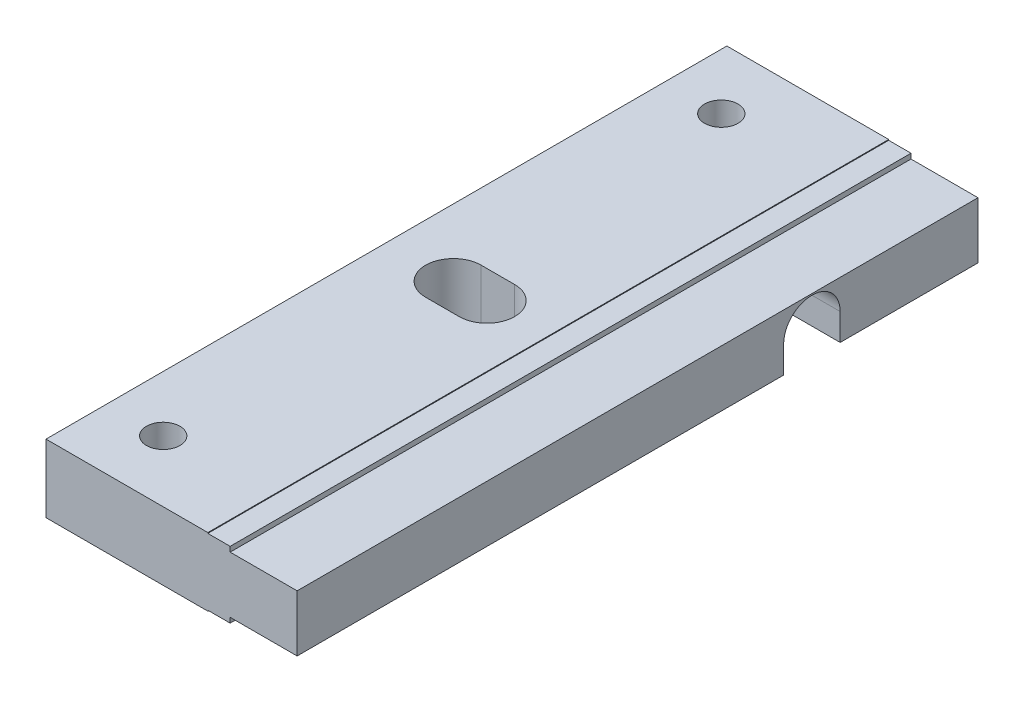
ISO-10303-21;
HEADER;
FILE_DESCRIPTION(('STEP AP214'),'2;1');
FILE_NAME('part.step','',(''),(''),'','','');
FILE_SCHEMA(('AUTOMOTIVE_DESIGN { 1 0 10303 214 1 1 1 1 }'));
ENDSEC;
DATA;
#1=APPLICATION_CONTEXT('core data for automotive mechanical design processes');
#2=APPLICATION_PROTOCOL_DEFINITION('international standard','automotive_design',2000,#1);
#3=PRODUCT_CONTEXT('',#1,'mechanical');
#4=PRODUCT('Part','Part','',(#3));
#5=PRODUCT_RELATED_PRODUCT_CATEGORY('part','',(#4));
#6=PRODUCT_DEFINITION_FORMATION('','',#4);
#7=PRODUCT_DEFINITION_CONTEXT('part definition',#1,'design');
#8=PRODUCT_DEFINITION('design','',#6,#7);
#9=PRODUCT_DEFINITION_SHAPE('','',#8);
#10=(LENGTH_UNIT() NAMED_UNIT(*) SI_UNIT(.MILLI.,.METRE.));
#11=(NAMED_UNIT(*) PLANE_ANGLE_UNIT() SI_UNIT($,.RADIAN.));
#12=(NAMED_UNIT(*) SI_UNIT($,.STERADIAN.) SOLID_ANGLE_UNIT());
#13=UNCERTAINTY_MEASURE_WITH_UNIT(LENGTH_MEASURE(1.E-05),#10,'distance_accuracy_value','');
#14=(GEOMETRIC_REPRESENTATION_CONTEXT(3) GLOBAL_UNCERTAINTY_ASSIGNED_CONTEXT((#13)) GLOBAL_UNIT_ASSIGNED_CONTEXT((#10,
#11,#12)) REPRESENTATION_CONTEXT('',''));
#15=CARTESIAN_POINT('',(0.,0.,0.));
#16=DIRECTION('',(0.,0.,1.));
#17=DIRECTION('',(1.,0.,0.));
#18=AXIS2_PLACEMENT_3D('',#15,#16,#17);
#19=CARTESIAN_POINT('',(22.5,-3.05,0.));
#20=DIRECTION('',(0.,1.,0.));
#21=DIRECTION('',(0.,0.,1.));
#22=AXIS2_PLACEMENT_3D('',#19,#20,#21);
#23=PLANE('',#22);
#24=CARTESIAN_POINT('',(5.00000000000001,-3.05,-5.5));
#25=DIRECTION('',(0.,1.,0.));
#26=DIRECTION('',(0.,0.,1.));
#27=AXIS2_PLACEMENT_3D('',#24,#25,#26);
#28=CIRCLE('',#27,1.5);
#29=CARTESIAN_POINT('',(5.00000000000001,-3.05,-4.));
#30=VERTEX_POINT('',#29);
#31=EDGE_CURVE('E272',#30,#30,#28,.T.);
#32=ORIENTED_EDGE('',*,*,#31,.T.);
#33=EDGE_LOOP('',(#32));
#34=FACE_BOUND('',#33,.T.);
#35=DIRECTION('',(-1.,0.,0.));
#36=VECTOR('',#35,1.);
#37=CARTESIAN_POINT('',(6.,-3.05,-32.9892));
#38=LINE('',#37,#36);
#39=CARTESIAN_POINT('',(9.,-3.05,-32.9892));
#40=VERTEX_POINT('',#39);
#41=CARTESIAN_POINT('',(6.,-3.05,-32.9892));
#42=VERTEX_POINT('',#41);
#43=EDGE_CURVE('E294',#40,#42,#38,.T.);
#44=ORIENTED_EDGE('',*,*,#43,.T.);
#45=CARTESIAN_POINT('',(6.,-3.05,-30.5));
#46=DIRECTION('',(0.,1.,0.));
#47=DIRECTION('',(0.,0.,1.));
#48=AXIS2_PLACEMENT_3D('',#45,#46,#47);
#49=CIRCLE('',#48,2.4892);
#50=CARTESIAN_POINT('',(6.,-3.05,-28.0108));
#51=VERTEX_POINT('',#50);
#52=EDGE_CURVE('E284',#42,#51,#49,.T.);
#53=ORIENTED_EDGE('',*,*,#52,.T.);
#54=DIRECTION('',(1.,0.,0.));
#55=VECTOR('',#54,1.);
#56=CARTESIAN_POINT('',(6.,-3.05,-28.0108));
#57=LINE('',#56,#55);
#58=CARTESIAN_POINT('',(9.,-3.05,-28.0108));
#59=VERTEX_POINT('',#58);
#60=EDGE_CURVE('E287',#51,#59,#57,.T.);
#61=ORIENTED_EDGE('',*,*,#60,.T.);
#62=CARTESIAN_POINT('',(9.,-3.05,-30.5));
#63=DIRECTION('',(0.,1.,0.));
#64=DIRECTION('',(0.,0.,1.));
#65=AXIS2_PLACEMENT_3D('',#62,#63,#64);
#66=CIRCLE('',#65,2.4892);
#67=EDGE_CURVE('E291',#59,#40,#66,.T.);
#68=ORIENTED_EDGE('',*,*,#67,.T.);
#69=EDGE_LOOP('',(#44,#53,#61,#68));
#70=FACE_BOUND('',#69,.T.);
#71=DIRECTION('',(-1.,0.,0.));
#72=VECTOR('',#71,1.);
#73=CARTESIAN_POINT('',(22.5,-3.05,-43.5866));
#74=LINE('',#73,#72);
#75=CARTESIAN_POINT('',(14.5,-3.05,-43.5866));
#76=VERTEX_POINT('',#75);
#77=CARTESIAN_POINT('',(0.,-3.05,-43.5866));
#78=VERTEX_POINT('',#77);
#79=EDGE_CURVE('E335',#76,#78,#74,.T.);
#80=ORIENTED_EDGE('',*,*,#79,.F.);
#81=DIRECTION('',(0.,0.,1.));
#82=VECTOR('',#81,1.);
#83=CARTESIAN_POINT('',(14.5,-3.05,-61.));
#84=LINE('',#83,#82);
#85=CARTESIAN_POINT('',(14.5,-3.05,0.));
#86=VERTEX_POINT('',#85);
#87=EDGE_CURVE('E257',#76,#86,#84,.T.);
#88=ORIENTED_EDGE('',*,*,#87,.T.);
#89=DIRECTION('',(-1.,0.,0.));
#90=VECTOR('',#89,1.);
#91=CARTESIAN_POINT('',(22.5,-3.05,0.));
#92=LINE('',#91,#90);
#93=CARTESIAN_POINT('',(0.,-3.05,0.));
#94=VERTEX_POINT('',#93);
#95=EDGE_CURVE('E225',#86,#94,#92,.T.);
#96=ORIENTED_EDGE('',*,*,#95,.T.);
#97=DIRECTION('',(0.,0.,-1.));
#98=VECTOR('',#97,1.);
#99=CARTESIAN_POINT('',(0.,-3.05,0.));
#100=LINE('',#99,#98);
#101=EDGE_CURVE('E354',#94,#78,#100,.T.);
#102=ORIENTED_EDGE('',*,*,#101,.T.);
#103=EDGE_LOOP('',(#80,#88,#96,#102));
#104=FACE_BOUND('',#103,.T.);
#105=ADVANCED_FACE('F36',(#34,#70,#104),#23,.F.);
#106=CARTESIAN_POINT('',(16.5,0.,-30.5));
#107=DIRECTION('',(1.,0.,0.));
#108=DIRECTION('',(0.,0.,-1.));
#109=AXIS2_PLACEMENT_3D('',#106,#107,#108);
#110=PLANE('',#109);
#111=DIRECTION('',(0.,0.,1.));
#112=VECTOR('',#111,1.);
#113=CARTESIAN_POINT('',(16.5,-2.98142,-61.));
#114=LINE('',#113,#112);
#115=CARTESIAN_POINT('',(16.5,-2.98142,-43.5866));
#116=VERTEX_POINT('',#115);
#117=CARTESIAN_POINT('',(16.5,-2.98142,0.));
#118=VERTEX_POINT('',#117);
#119=EDGE_CURVE('E256',#116,#118,#114,.T.);
#120=ORIENTED_EDGE('',*,*,#119,.F.);
#121=DIRECTION('',(0.,-1.,0.));
#122=VECTOR('',#121,1.);
#123=CARTESIAN_POINT('',(16.5,0.,-43.5866));
#124=LINE('',#123,#122);
#125=CARTESIAN_POINT('',(16.5,-2.52902000000001,-43.5866));
#126=VERTEX_POINT('',#125);
#127=EDGE_CURVE('E59',#126,#116,#124,.T.);
#128=ORIENTED_EDGE('',*,*,#127,.F.);
#129=DIRECTION('',(0.,0.,1.));
#130=VECTOR('',#129,1.);
#131=CARTESIAN_POINT('',(16.5,-2.52902000000001,-61.));
#132=LINE('',#131,#130);
#133=CARTESIAN_POINT('',(16.5,-2.52902000000001,0.));
#134=VERTEX_POINT('',#133);
#135=EDGE_CURVE('E396',#126,#134,#132,.T.);
#136=ORIENTED_EDGE('',*,*,#135,.T.);
#137=DIRECTION('',(0.,-1.,0.));
#138=VECTOR('',#137,1.);
#139=CARTESIAN_POINT('',(16.5,-3.05,0.));
#140=LINE('',#139,#138);
#141=EDGE_CURVE('E344',#134,#118,#140,.T.);
#142=ORIENTED_EDGE('',*,*,#141,.T.);
#143=EDGE_LOOP('',(#120,#128,#136,#142));
#144=FACE_BOUND('',#143,.T.);
#145=ADVANCED_FACE('F421',(#144),#110,.T.);
#146=CARTESIAN_POINT('',(22.5,-3.05,0.));
#147=DIRECTION('',(0.,0.,-1.));
#148=DIRECTION('',(-1.,0.,0.));
#149=AXIS2_PLACEMENT_3D('',#146,#147,#148);
#150=PLANE('',#149);
#151=CARTESIAN_POINT('',(16.5,2.98142,0.));
#152=VERTEX_POINT('',#151);
#153=CARTESIAN_POINT('',(16.5,2.52902,0.));
#154=VERTEX_POINT('',#153);
#155=EDGE_CURVE('E341',#152,#154,#140,.T.);
#156=ORIENTED_EDGE('',*,*,#155,.F.);
#157=DIRECTION('',(1.,0.,0.));
#158=VECTOR('',#157,1.);
#159=CARTESIAN_POINT('',(16.5,2.98142,0.));
#160=LINE('',#159,#158);
#161=CARTESIAN_POINT('',(14.5,2.98142,0.));
#162=VERTEX_POINT('',#161);
#163=EDGE_CURVE('E51',#162,#152,#160,.T.);
#164=ORIENTED_EDGE('',*,*,#163,.F.);
#165=DIRECTION('',(0.,-1.,0.));
#166=VECTOR('',#165,1.);
#167=CARTESIAN_POINT('',(14.5,3.05,0.));
#168=LINE('',#167,#166);
#169=CARTESIAN_POINT('',(14.5,3.05,0.));
#170=VERTEX_POINT('',#169);
#171=EDGE_CURVE('E366',#170,#162,#168,.T.);
#172=ORIENTED_EDGE('',*,*,#171,.F.);
#173=DIRECTION('',(-1.,0.,0.));
#174=VECTOR('',#173,1.);
#175=CARTESIAN_POINT('',(22.5,3.05,0.));
#176=LINE('',#175,#174);
#177=CARTESIAN_POINT('',(0.,3.05,0.));
#178=VERTEX_POINT('',#177);
#179=EDGE_CURVE('E217',#170,#178,#176,.T.);
#180=ORIENTED_EDGE('',*,*,#179,.T.);
#181=DIRECTION('',(0.,-1.,0.));
#182=VECTOR('',#181,1.);
#183=CARTESIAN_POINT('',(0.,-3.05,0.));
#184=LINE('',#183,#182);
#185=EDGE_CURVE('E350',#178,#94,#184,.T.);
#186=ORIENTED_EDGE('',*,*,#185,.T.);
#187=ORIENTED_EDGE('',*,*,#95,.F.);
#188=DIRECTION('',(0.,-1.,0.));
#189=VECTOR('',#188,1.);
#190=CARTESIAN_POINT('',(14.5,-2.98142,0.));
#191=LINE('',#190,#189);
#192=CARTESIAN_POINT('',(14.5,-2.98142,0.));
#193=VERTEX_POINT('',#192);
#194=EDGE_CURVE('E401',#193,#86,#191,.T.);
#195=ORIENTED_EDGE('',*,*,#194,.F.);
#196=DIRECTION('',(-1.,0.,0.));
#197=VECTOR('',#196,1.);
#198=CARTESIAN_POINT('',(14.5,-2.98142,0.));
#199=LINE('',#198,#197);
#200=EDGE_CURVE('E404',#118,#193,#199,.T.);
#201=ORIENTED_EDGE('',*,*,#200,.F.);
#202=ORIENTED_EDGE('',*,*,#141,.F.);
#203=DIRECTION('',(-1.,0.,0.));
#204=VECTOR('',#203,1.);
#205=CARTESIAN_POINT('',(16.5,-2.52902000000001,0.));
#206=LINE('',#205,#204);
#207=CARTESIAN_POINT('',(22.5,-2.52902000000001,0.));
#208=VERTEX_POINT('',#207);
#209=EDGE_CURVE('E383',#208,#134,#206,.T.);
#210=ORIENTED_EDGE('',*,*,#209,.F.);
#211=DIRECTION('',(0.,-1.,0.));
#212=VECTOR('',#211,1.);
#213=CARTESIAN_POINT('',(22.5,-3.05,0.));
#214=LINE('',#213,#212);
#215=CARTESIAN_POINT('',(22.5,2.52902,0.));
#216=VERTEX_POINT('',#215);
#217=EDGE_CURVE('E345',#216,#208,#214,.T.);
#218=ORIENTED_EDGE('',*,*,#217,.F.);
#219=DIRECTION('',(1.,0.,0.));
#220=VECTOR('',#219,1.);
#221=CARTESIAN_POINT('',(22.5,2.52902,0.));
#222=LINE('',#221,#220);
#223=EDGE_CURVE('E373',#154,#216,#222,.T.);
#224=ORIENTED_EDGE('',*,*,#223,.F.);
#225=EDGE_LOOP('',(#156,#164,#172,#180,#186,#187,#195,#201,#202,#210,#218,#224));
#226=FACE_BOUND('',#225,.T.);
#227=ADVANCED_FACE('F38',(#226),#150,.F.);
#228=CARTESIAN_POINT('',(5.,-3.05,-55.5));
#229=DIRECTION('',(0.,1.,0.));
#230=DIRECTION('',(0.,0.,1.));
#231=AXIS2_PLACEMENT_3D('',#228,#229,#230);
#232=CIRCLE('',#231,1.5);
#233=CARTESIAN_POINT('',(5.,-3.05,-54.));
#234=VERTEX_POINT('',#233);
#235=EDGE_CURVE('E278',#234,#234,#232,.T.);
#236=ORIENTED_EDGE('',*,*,#235,.T.);
#237=EDGE_LOOP('',(#236));
#238=FACE_BOUND('',#237,.T.);
#239=DIRECTION('',(-1.,0.,0.));
#240=VECTOR('',#239,1.);
#241=CARTESIAN_POINT('',(22.5,-3.05,-61.));
#242=LINE('',#241,#240);
#243=CARTESIAN_POINT('',(14.5,-3.05,-61.));
#244=VERTEX_POINT('',#243);
#245=CARTESIAN_POINT('',(0.,-3.05,-61.));
#246=VERTEX_POINT('',#245);
#247=EDGE_CURVE('E223',#244,#246,#242,.T.);
#248=ORIENTED_EDGE('',*,*,#247,.F.);
#249=CARTESIAN_POINT('',(14.5,-3.05,-48.6514));
#250=VERTEX_POINT('',#249);
#251=EDGE_CURVE('E249',#244,#250,#84,.T.);
#252=ORIENTED_EDGE('',*,*,#251,.T.);
#253=DIRECTION('',(-1.,0.,0.));
#254=VECTOR('',#253,1.);
#255=CARTESIAN_POINT('',(22.5,-3.05,-48.6514));
#256=LINE('',#255,#254);
#257=CARTESIAN_POINT('',(0.,-3.05,-48.6514));
#258=VERTEX_POINT('',#257);
#259=EDGE_CURVE('E243',#250,#258,#256,.T.);
#260=ORIENTED_EDGE('',*,*,#259,.T.);
#261=EDGE_CURVE('E353',#258,#246,#100,.T.);
#262=ORIENTED_EDGE('',*,*,#261,.T.);
#263=EDGE_LOOP('',(#248,#252,#260,#262));
#264=FACE_BOUND('',#263,.T.);
#265=ADVANCED_FACE('F254',(#238,#264),#23,.F.);
#266=CARTESIAN_POINT('',(22.5,-3.05,-61.));
#267=DIRECTION('',(0.,0.,1.));
#268=DIRECTION('',(1.,0.,0.));
#269=AXIS2_PLACEMENT_3D('',#266,#267,#268);
#270=PLANE('',#269);
#271=DIRECTION('',(0.,-1.,0.));
#272=VECTOR('',#271,1.);
#273=CARTESIAN_POINT('',(14.5,3.05,-61.));
#274=LINE('',#273,#272);
#275=CARTESIAN_POINT('',(14.5,3.05,-61.));
#276=VERTEX_POINT('',#275);
#277=CARTESIAN_POINT('',(14.5,2.98142,-61.));
#278=VERTEX_POINT('',#277);
#279=EDGE_CURVE('E198',#276,#278,#274,.T.);
#280=ORIENTED_EDGE('',*,*,#279,.T.);
#281=DIRECTION('',(1.,0.,0.));
#282=VECTOR('',#281,1.);
#283=CARTESIAN_POINT('',(16.5,2.98142,-61.));
#284=LINE('',#283,#282);
#285=CARTESIAN_POINT('',(16.5,2.98142,-61.));
#286=VERTEX_POINT('',#285);
#287=EDGE_CURVE('E209',#278,#286,#284,.T.);
#288=ORIENTED_EDGE('',*,*,#287,.T.);
#289=DIRECTION('',(0.,1.,0.));
#290=VECTOR('',#289,1.);
#291=CARTESIAN_POINT('',(16.5,-3.05,-61.));
#292=LINE('',#291,#290);
#293=CARTESIAN_POINT('',(16.5,2.52902,-61.));
#294=VERTEX_POINT('',#293);
#295=EDGE_CURVE('E334',#294,#286,#292,.T.);
#296=ORIENTED_EDGE('',*,*,#295,.F.);
#297=DIRECTION('',(1.,0.,0.));
#298=VECTOR('',#297,1.);
#299=CARTESIAN_POINT('',(22.5,2.52902,-61.));
#300=LINE('',#299,#298);
#301=CARTESIAN_POINT('',(22.5,2.52902,-61.));
#302=VERTEX_POINT('',#301);
#303=EDGE_CURVE('E375',#294,#302,#300,.T.);
#304=ORIENTED_EDGE('',*,*,#303,.T.);
#305=DIRECTION('',(0.,1.,0.));
#306=VECTOR('',#305,1.);
#307=CARTESIAN_POINT('',(22.5,-3.05,-61.));
#308=LINE('',#307,#306);
#309=CARTESIAN_POINT('',(22.5,-2.52902000000001,-61.));
#310=VERTEX_POINT('',#309);
#311=EDGE_CURVE('E227',#310,#302,#308,.T.);
#312=ORIENTED_EDGE('',*,*,#311,.F.);
#313=DIRECTION('',(-1.,0.,0.));
#314=VECTOR('',#313,1.);
#315=CARTESIAN_POINT('',(16.5,-2.52902000000001,-61.));
#316=LINE('',#315,#314);
#317=CARTESIAN_POINT('',(16.5,-2.52902000000001,-61.));
#318=VERTEX_POINT('',#317);
#319=EDGE_CURVE('E386',#310,#318,#316,.T.);
#320=ORIENTED_EDGE('',*,*,#319,.T.);
#321=CARTESIAN_POINT('',(16.5,-2.98142,-61.));
#322=VERTEX_POINT('',#321);
#323=EDGE_CURVE('E342',#322,#318,#292,.T.);
#324=ORIENTED_EDGE('',*,*,#323,.F.);
#325=DIRECTION('',(-1.,0.,0.));
#326=VECTOR('',#325,1.);
#327=CARTESIAN_POINT('',(14.5,-2.98142,-61.));
#328=LINE('',#327,#326);
#329=CARTESIAN_POINT('',(14.5,-2.98142,-61.));
#330=VERTEX_POINT('',#329);
#331=EDGE_CURVE('E262',#322,#330,#328,.T.);
#332=ORIENTED_EDGE('',*,*,#331,.T.);
#333=DIRECTION('',(0.,-1.,0.));
#334=VECTOR('',#333,1.);
#335=CARTESIAN_POINT('',(14.5,-2.98142,-61.));
#336=LINE('',#335,#334);
#337=EDGE_CURVE('E402',#330,#244,#336,.T.);
#338=ORIENTED_EDGE('',*,*,#337,.T.);
#339=ORIENTED_EDGE('',*,*,#247,.T.);
#340=DIRECTION('',(0.,1.,0.));
#341=VECTOR('',#340,1.);
#342=CARTESIAN_POINT('',(0.,-3.05,-61.));
#343=LINE('',#342,#341);
#344=CARTESIAN_POINT('',(0.,3.05,-61.));
#345=VERTEX_POINT('',#344);
#346=EDGE_CURVE('E221',#246,#345,#343,.T.);
#347=ORIENTED_EDGE('',*,*,#346,.T.);
#348=DIRECTION('',(-1.,0.,0.));
#349=VECTOR('',#348,1.);
#350=CARTESIAN_POINT('',(22.5,3.05,-61.));
#351=LINE('',#350,#349);
#352=EDGE_CURVE('E215',#276,#345,#351,.T.);
#353=ORIENTED_EDGE('',*,*,#352,.F.);
#354=EDGE_LOOP('',(#280,#288,#296,#304,#312,#320,#324,#332,#338,#339,#347,#353));
#355=FACE_BOUND('',#354,.T.);
#356=ADVANCED_FACE('F219',(#355),#270,.F.);
#357=CARTESIAN_POINT('',(22.5,3.05,0.));
#358=DIRECTION('',(0.,-1.,0.));
#359=DIRECTION('',(0.,0.,-1.));
#360=AXIS2_PLACEMENT_3D('',#357,#358,#359);
#361=PLANE('',#360);
#362=CARTESIAN_POINT('',(5.00000000000001,3.05,-5.5));
#363=DIRECTION('',(0.,1.,0.));
#364=DIRECTION('',(0.,0.,1.));
#365=AXIS2_PLACEMENT_3D('',#362,#363,#364);
#366=CIRCLE('',#365,1.5);
#367=CARTESIAN_POINT('',(5.00000000000001,3.05,-4.));
#368=VERTEX_POINT('',#367);
#369=EDGE_CURVE('E271',#368,#368,#366,.T.);
#370=ORIENTED_EDGE('',*,*,#369,.F.);
#371=EDGE_LOOP('',(#370));
#372=FACE_BOUND('',#371,.T.);
#373=CARTESIAN_POINT('',(5.,3.05,-55.5));
#374=DIRECTION('',(0.,1.,0.));
#375=DIRECTION('',(0.,0.,1.));
#376=AXIS2_PLACEMENT_3D('',#373,#374,#375);
#377=CIRCLE('',#376,1.5);
#378=CARTESIAN_POINT('',(5.,3.05,-54.));
#379=VERTEX_POINT('',#378);
#380=EDGE_CURVE('E275',#379,#379,#377,.T.);
#381=ORIENTED_EDGE('',*,*,#380,.F.);
#382=EDGE_LOOP('',(#381));
#383=FACE_BOUND('',#382,.T.);
#384=DIRECTION('',(1.,0.,0.));
#385=VECTOR('',#384,1.);
#386=CARTESIAN_POINT('',(6.,3.05,-28.0108));
#387=LINE('',#386,#385);
#388=CARTESIAN_POINT('',(6.,3.05,-28.0108));
#389=VERTEX_POINT('',#388);
#390=CARTESIAN_POINT('',(9.,3.05,-28.0108));
#391=VERTEX_POINT('',#390);
#392=EDGE_CURVE('E299',#389,#391,#387,.T.);
#393=ORIENTED_EDGE('',*,*,#392,.F.);
#394=CARTESIAN_POINT('',(6.,3.05,-30.5));
#395=DIRECTION('',(0.,1.,0.));
#396=DIRECTION('',(0.,0.,1.));
#397=AXIS2_PLACEMENT_3D('',#394,#395,#396);
#398=CIRCLE('',#397,2.4892);
#399=CARTESIAN_POINT('',(6.,3.05,-32.9892));
#400=VERTEX_POINT('',#399);
#401=EDGE_CURVE('E281',#400,#389,#398,.T.);
#402=ORIENTED_EDGE('',*,*,#401,.F.);
#403=DIRECTION('',(-1.,0.,0.));
#404=VECTOR('',#403,1.);
#405=CARTESIAN_POINT('',(6.,3.05,-32.9892));
#406=LINE('',#405,#404);
#407=CARTESIAN_POINT('',(9.,3.05,-32.9892));
#408=VERTEX_POINT('',#407);
#409=EDGE_CURVE('E288',#408,#400,#406,.T.);
#410=ORIENTED_EDGE('',*,*,#409,.F.);
#411=CARTESIAN_POINT('',(9.,3.05,-30.5));
#412=DIRECTION('',(0.,1.,0.));
#413=DIRECTION('',(0.,0.,1.));
#414=AXIS2_PLACEMENT_3D('',#411,#412,#413);
#415=CIRCLE('',#414,2.4892);
#416=EDGE_CURVE('E302',#391,#408,#415,.T.);
#417=ORIENTED_EDGE('',*,*,#416,.F.);
#418=EDGE_LOOP('',(#393,#402,#410,#417));
#419=FACE_BOUND('',#418,.T.);
#420=ORIENTED_EDGE('',*,*,#179,.F.);
#421=DIRECTION('',(0.,0.,1.));
#422=VECTOR('',#421,1.);
#423=CARTESIAN_POINT('',(14.5,3.05,-61.));
#424=LINE('',#423,#422);
#425=EDGE_CURVE('E202',#276,#170,#424,.T.);
#426=ORIENTED_EDGE('',*,*,#425,.F.);
#427=ORIENTED_EDGE('',*,*,#352,.T.);
#428=DIRECTION('',(0.,0.,1.));
#429=VECTOR('',#428,1.);
#430=CARTESIAN_POINT('',(0.,3.05,0.));
#431=LINE('',#430,#429);
#432=EDGE_CURVE('E347',#345,#178,#431,.T.);
#433=ORIENTED_EDGE('',*,*,#432,.T.);
#434=EDGE_LOOP('',(#420,#426,#427,#433));
#435=FACE_BOUND('',#434,.T.);
#436=ADVANCED_FACE('F213',(#372,#383,#419,#435),#361,.F.);
#437=CARTESIAN_POINT('',(22.5,3.05,0.));
#438=DIRECTION('',(-1.,0.,0.));
#439=DIRECTION('',(0.,0.,1.));
#440=AXIS2_PLACEMENT_3D('',#437,#438,#439);
#441=PLANE('',#440);
#442=ORIENTED_EDGE('',*,*,#311,.T.);
#443=DIRECTION('',(0.,0.,1.));
#444=VECTOR('',#443,1.);
#445=CARTESIAN_POINT('',(22.5,2.52902,-61.));
#446=LINE('',#445,#444);
#447=EDGE_CURVE('E380',#302,#216,#446,.T.);
#448=ORIENTED_EDGE('',*,*,#447,.T.);
#449=ORIENTED_EDGE('',*,*,#217,.T.);
#450=DIRECTION('',(0.,0.,1.));
#451=VECTOR('',#450,1.);
#452=CARTESIAN_POINT('',(22.5,-2.52902000000001,-61.));
#453=LINE('',#452,#451);
#454=CARTESIAN_POINT('',(22.5,-2.52902000000001,-43.5866));
#455=VERTEX_POINT('',#454);
#456=EDGE_CURVE('E389',#455,#208,#453,.T.);
#457=ORIENTED_EDGE('',*,*,#456,.F.);
#458=DIRECTION('',(0.,1.,0.));
#459=VECTOR('',#458,1.);
#460=CARTESIAN_POINT('',(22.5,-0.127799999999991,-43.5866));
#461=LINE('',#460,#459);
#462=CARTESIAN_POINT('',(22.5,-0.127799999999991,-43.5866));
#463=VERTEX_POINT('',#462);
#464=EDGE_CURVE('E323',#455,#463,#461,.T.);
#465=ORIENTED_EDGE('',*,*,#464,.T.);
#466=CARTESIAN_POINT('',(22.5,-0.127799999999992,-46.119));
#467=DIRECTION('',(-1.,0.,0.));
#468=DIRECTION('',(0.,0.,1.));
#469=AXIS2_PLACEMENT_3D('',#466,#467,#468);
#470=CIRCLE('',#469,2.5324);
#471=CARTESIAN_POINT('',(22.5,-0.127799999999992,-48.6514));
#472=VERTEX_POINT('',#471);
#473=EDGE_CURVE('E316',#463,#472,#470,.T.);
#474=ORIENTED_EDGE('',*,*,#473,.T.);
#475=DIRECTION('',(0.,-1.,0.));
#476=VECTOR('',#475,1.);
#477=CARTESIAN_POINT('',(22.5,-3.05,-48.6514));
#478=LINE('',#477,#476);
#479=CARTESIAN_POINT('',(22.5,-2.52902000000001,-48.6514));
#480=VERTEX_POINT('',#479);
#481=EDGE_CURVE('E319',#472,#480,#478,.T.);
#482=ORIENTED_EDGE('',*,*,#481,.T.);
#483=EDGE_CURVE('E397',#310,#480,#453,.T.);
#484=ORIENTED_EDGE('',*,*,#483,.F.);
#485=EDGE_LOOP('',(#442,#448,#449,#457,#465,#474,#482,#484));
#486=FACE_BOUND('',#485,.T.);
#487=ADVANCED_FACE('F437',(#486),#441,.F.);
#488=CARTESIAN_POINT('',(0.,3.05,0.));
#489=DIRECTION('',(-1.,0.,0.));
#490=DIRECTION('',(0.,0.,1.));
#491=AXIS2_PLACEMENT_3D('',#488,#489,#490);
#492=PLANE('',#491);
#493=DIRECTION('',(0.,1.,0.));
#494=VECTOR('',#493,1.);
#495=CARTESIAN_POINT('',(0.,-0.127799999999991,-43.5866));
#496=LINE('',#495,#494);
#497=CARTESIAN_POINT('',(0.,-0.127799999999991,-43.5866));
#498=VERTEX_POINT('',#497);
#499=EDGE_CURVE('E320',#78,#498,#496,.T.);
#500=ORIENTED_EDGE('',*,*,#499,.F.);
#501=ORIENTED_EDGE('',*,*,#101,.F.);
#502=ORIENTED_EDGE('',*,*,#185,.F.);
#503=ORIENTED_EDGE('',*,*,#432,.F.);
#504=ORIENTED_EDGE('',*,*,#346,.F.);
#505=ORIENTED_EDGE('',*,*,#261,.F.);
#506=DIRECTION('',(0.,-1.,0.));
#507=VECTOR('',#506,1.);
#508=CARTESIAN_POINT('',(0.,-3.05,-48.6514));
#509=LINE('',#508,#507);
#510=CARTESIAN_POINT('',(0.,-0.127799999999992,-48.6514));
#511=VERTEX_POINT('',#510);
#512=EDGE_CURVE('E328',#511,#258,#509,.T.);
#513=ORIENTED_EDGE('',*,*,#512,.F.);
#514=CARTESIAN_POINT('',(0.,-0.127799999999992,-46.119));
#515=DIRECTION('',(-1.,0.,0.));
#516=DIRECTION('',(0.,0.,1.));
#517=AXIS2_PLACEMENT_3D('',#514,#515,#516);
#518=CIRCLE('',#517,2.5324);
#519=EDGE_CURVE('E309',#498,#511,#518,.T.);
#520=ORIENTED_EDGE('',*,*,#519,.F.);
#521=EDGE_LOOP('',(#500,#501,#502,#503,#504,#505,#513,#520));
#522=FACE_BOUND('',#521,.T.);
#523=ADVANCED_FACE('F361',(#522),#492,.T.);
#524=CARTESIAN_POINT('',(16.5,-2.98142,-48.6514));
#525=VERTEX_POINT('',#524);
#526=EDGE_CURVE('E259',#322,#525,#114,.T.);
#527=ORIENTED_EDGE('',*,*,#526,.F.);
#528=ORIENTED_EDGE('',*,*,#323,.T.);
#529=CARTESIAN_POINT('',(16.5,-2.52902000000001,-48.6514));
#530=VERTEX_POINT('',#529);
#531=EDGE_CURVE('E392',#318,#530,#132,.T.);
#532=ORIENTED_EDGE('',*,*,#531,.T.);
#533=DIRECTION('',(0.,1.,0.));
#534=VECTOR('',#533,1.);
#535=CARTESIAN_POINT('',(16.5,0.,-48.6514));
#536=LINE('',#535,#534);
#537=EDGE_CURVE('E232',#525,#530,#536,.T.);
#538=ORIENTED_EDGE('',*,*,#537,.F.);
#539=EDGE_LOOP('',(#527,#528,#532,#538));
#540=FACE_BOUND('',#539,.T.);
#541=ADVANCED_FACE('F417',(#540),#110,.T.);
#542=DIRECTION('',(0.,0.,1.));
#543=VECTOR('',#542,1.);
#544=CARTESIAN_POINT('',(16.5,2.98142,-61.));
#545=LINE('',#544,#543);
#546=EDGE_CURVE('E371',#286,#152,#545,.T.);
#547=ORIENTED_EDGE('',*,*,#546,.T.);
#548=ORIENTED_EDGE('',*,*,#155,.T.);
#549=DIRECTION('',(0.,0.,1.));
#550=VECTOR('',#549,1.);
#551=CARTESIAN_POINT('',(16.5,2.52902,-61.));
#552=LINE('',#551,#550);
#553=EDGE_CURVE('E378',#294,#154,#552,.T.);
#554=ORIENTED_EDGE('',*,*,#553,.F.);
#555=ORIENTED_EDGE('',*,*,#295,.T.);
#556=EDGE_LOOP('',(#547,#548,#554,#555));
#557=FACE_BOUND('',#556,.T.);
#558=ADVANCED_FACE('F444',(#557),#110,.T.);
#559=CARTESIAN_POINT('',(22.5,-0.127799999999992,-46.119));
#560=DIRECTION('',(-1.,0.,0.));
#561=DIRECTION('',(0.,0.,1.));
#562=AXIS2_PLACEMENT_3D('',#559,#560,#561);
#563=CYLINDRICAL_SURFACE('',#562,2.5324);
#564=ORIENTED_EDGE('',*,*,#519,.T.);
#565=DIRECTION('',(-1.,0.,0.));
#566=VECTOR('',#565,1.);
#567=CARTESIAN_POINT('',(22.5,-0.127799999999992,-48.6514));
#568=LINE('',#567,#566);
#569=EDGE_CURVE('E325',#472,#511,#568,.T.);
#570=ORIENTED_EDGE('',*,*,#569,.F.);
#571=ORIENTED_EDGE('',*,*,#473,.F.);
#572=DIRECTION('',(-1.,0.,0.));
#573=VECTOR('',#572,1.);
#574=CARTESIAN_POINT('',(22.5,-0.127799999999991,-43.5866));
#575=LINE('',#574,#573);
#576=EDGE_CURVE('E332',#463,#498,#575,.T.);
#577=ORIENTED_EDGE('',*,*,#576,.T.);
#578=EDGE_LOOP('',(#564,#570,#571,#577));
#579=FACE_BOUND('',#578,.T.);
#580=ADVANCED_FACE('F453',(#579),#563,.F.);
#581=CARTESIAN_POINT('',(22.5,-0.127799999999991,-43.5866));
#582=DIRECTION('',(0.,0.,1.));
#583=DIRECTION('',(1.,0.,0.));
#584=AXIS2_PLACEMENT_3D('',#581,#582,#583);
#585=PLANE('',#584);
#586=DIRECTION('',(-1.,0.,0.));
#587=VECTOR('',#586,1.);
#588=CARTESIAN_POINT('',(22.5,-2.52902000000001,-43.5866));
#589=LINE('',#588,#587);
#590=EDGE_CURVE('E395',#455,#126,#589,.T.);
#591=ORIENTED_EDGE('',*,*,#590,.T.);
#592=ORIENTED_EDGE('',*,*,#127,.T.);
#593=DIRECTION('',(-1.,0.,0.));
#594=VECTOR('',#593,1.);
#595=CARTESIAN_POINT('',(22.5,-2.98142,-43.5866));
#596=LINE('',#595,#594);
#597=CARTESIAN_POINT('',(14.5,-2.98142,-43.5866));
#598=VERTEX_POINT('',#597);
#599=EDGE_CURVE('E265',#116,#598,#596,.T.);
#600=ORIENTED_EDGE('',*,*,#599,.T.);
#601=DIRECTION('',(0.,-1.,0.));
#602=VECTOR('',#601,1.);
#603=CARTESIAN_POINT('',(14.4999999999999,-0.127800000000194,-43.5866));
#604=LINE('',#603,#602);
#605=EDGE_CURVE('E268',#598,#76,#604,.T.);
#606=ORIENTED_EDGE('',*,*,#605,.T.);
#607=ORIENTED_EDGE('',*,*,#79,.T.);
#608=ORIENTED_EDGE('',*,*,#499,.T.);
#609=ORIENTED_EDGE('',*,*,#576,.F.);
#610=ORIENTED_EDGE('',*,*,#464,.F.);
#611=EDGE_LOOP('',(#591,#592,#600,#606,#607,#608,#609,#610));
#612=FACE_BOUND('',#611,.T.);
#613=ADVANCED_FACE('F428',(#612),#585,.F.);
#614=CARTESIAN_POINT('',(22.5,-3.05,-48.6514));
#615=DIRECTION('',(0.,0.,-1.));
#616=DIRECTION('',(0.,1.,0.));
#617=AXIS2_PLACEMENT_3D('',#614,#615,#616);
#618=PLANE('',#617);
#619=ORIENTED_EDGE('',*,*,#537,.T.);
#620=DIRECTION('',(1.,0.,0.));
#621=VECTOR('',#620,1.);
#622=CARTESIAN_POINT('',(22.5,-2.52902000000001,-48.6514));
#623=LINE('',#622,#621);
#624=EDGE_CURVE('E12',#530,#480,#623,.T.);
#625=ORIENTED_EDGE('',*,*,#624,.T.);
#626=ORIENTED_EDGE('',*,*,#481,.F.);
#627=ORIENTED_EDGE('',*,*,#569,.T.);
#628=ORIENTED_EDGE('',*,*,#512,.T.);
#629=ORIENTED_EDGE('',*,*,#259,.F.);
#630=DIRECTION('',(0.,1.,0.));
#631=VECTOR('',#630,1.);
#632=CARTESIAN_POINT('',(14.5,-3.0500000000002,-48.6514));
#633=LINE('',#632,#631);
#634=CARTESIAN_POINT('',(14.5,-2.98142,-48.6514));
#635=VERTEX_POINT('',#634);
#636=EDGE_CURVE('E44',#250,#635,#633,.T.);
#637=ORIENTED_EDGE('',*,*,#636,.T.);
#638=DIRECTION('',(1.,0.,0.));
#639=VECTOR('',#638,1.);
#640=CARTESIAN_POINT('',(22.5,-2.98142,-48.6514));
#641=LINE('',#640,#639);
#642=EDGE_CURVE('E235',#635,#525,#641,.T.);
#643=ORIENTED_EDGE('',*,*,#642,.T.);
#644=EDGE_LOOP('',(#619,#625,#626,#627,#628,#629,#637,#643));
#645=FACE_BOUND('',#644,.T.);
#646=ADVANCED_FACE('F240',(#645),#618,.F.);
#647=CARTESIAN_POINT('',(6.,-3.05,-30.5));
#648=DIRECTION('',(0.,1.,0.));
#649=DIRECTION('',(0.,0.,1.));
#650=AXIS2_PLACEMENT_3D('',#647,#648,#649);
#651=CYLINDRICAL_SURFACE('',#650,2.4892);
#652=ORIENTED_EDGE('',*,*,#401,.T.);
#653=DIRECTION('',(0.,1.,0.));
#654=VECTOR('',#653,1.);
#655=CARTESIAN_POINT('',(6.,-3.05,-28.0108));
#656=LINE('',#655,#654);
#657=EDGE_CURVE('E297',#51,#389,#656,.T.);
#658=ORIENTED_EDGE('',*,*,#657,.F.);
#659=ORIENTED_EDGE('',*,*,#52,.F.);
#660=DIRECTION('',(0.,1.,0.));
#661=VECTOR('',#660,1.);
#662=CARTESIAN_POINT('',(6.,-3.05,-32.9892));
#663=LINE('',#662,#661);
#664=EDGE_CURVE('E307',#42,#400,#663,.T.);
#665=ORIENTED_EDGE('',*,*,#664,.T.);
#666=EDGE_LOOP('',(#652,#658,#659,#665));
#667=FACE_BOUND('',#666,.T.);
#668=ADVANCED_FACE('F504',(#667),#651,.F.);
#669=CARTESIAN_POINT('',(6.,-3.05,-32.9892));
#670=DIRECTION('',(0.,0.,-1.));
#671=DIRECTION('',(-1.,0.,0.));
#672=AXIS2_PLACEMENT_3D('',#669,#670,#671);
#673=PLANE('',#672);
#674=ORIENTED_EDGE('',*,*,#409,.T.);
#675=ORIENTED_EDGE('',*,*,#664,.F.);
#676=ORIENTED_EDGE('',*,*,#43,.F.);
#677=DIRECTION('',(0.,1.,0.));
#678=VECTOR('',#677,1.);
#679=CARTESIAN_POINT('',(9.,-3.05,-32.9892));
#680=LINE('',#679,#678);
#681=EDGE_CURVE('E310',#40,#408,#680,.T.);
#682=ORIENTED_EDGE('',*,*,#681,.T.);
#683=EDGE_LOOP('',(#674,#675,#676,#682));
#684=FACE_BOUND('',#683,.T.);
#685=ADVANCED_FACE('F507',(#684),#673,.F.);
#686=CARTESIAN_POINT('',(9.,-3.05,-30.5));
#687=DIRECTION('',(0.,1.,0.));
#688=DIRECTION('',(0.,0.,1.));
#689=AXIS2_PLACEMENT_3D('',#686,#687,#688);
#690=CYLINDRICAL_SURFACE('',#689,2.4892);
#691=ORIENTED_EDGE('',*,*,#416,.T.);
#692=ORIENTED_EDGE('',*,*,#681,.F.);
#693=ORIENTED_EDGE('',*,*,#67,.F.);
#694=DIRECTION('',(0.,1.,0.));
#695=VECTOR('',#694,1.);
#696=CARTESIAN_POINT('',(9.,-3.05,-28.0108));
#697=LINE('',#696,#695);
#698=EDGE_CURVE('E312',#59,#391,#697,.T.);
#699=ORIENTED_EDGE('',*,*,#698,.T.);
#700=EDGE_LOOP('',(#691,#692,#693,#699));
#701=FACE_BOUND('',#700,.T.);
#702=ADVANCED_FACE('F509',(#701),#690,.F.);
#703=CARTESIAN_POINT('',(6.,-3.05,-28.0108));
#704=DIRECTION('',(0.,0.,1.));
#705=DIRECTION('',(1.,0.,0.));
#706=AXIS2_PLACEMENT_3D('',#703,#704,#705);
#707=PLANE('',#706);
#708=ORIENTED_EDGE('',*,*,#392,.T.);
#709=ORIENTED_EDGE('',*,*,#698,.F.);
#710=ORIENTED_EDGE('',*,*,#60,.F.);
#711=ORIENTED_EDGE('',*,*,#657,.T.);
#712=EDGE_LOOP('',(#708,#709,#710,#711));
#713=FACE_BOUND('',#712,.T.);
#714=ADVANCED_FACE('F487',(#713),#707,.F.);
#715=CARTESIAN_POINT('',(5.,-3.05,-55.5));
#716=DIRECTION('',(0.,1.,0.));
#717=DIRECTION('',(0.,0.,1.));
#718=AXIS2_PLACEMENT_3D('',#715,#716,#717);
#719=CYLINDRICAL_SURFACE('',#718,1.5);
#720=ORIENTED_EDGE('',*,*,#235,.F.);
#721=EDGE_LOOP('',(#720));
#722=FACE_BOUND('',#721,.T.);
#723=ORIENTED_EDGE('',*,*,#380,.T.);
#724=EDGE_LOOP('',(#723));
#725=FACE_BOUND('',#724,.T.);
#726=ADVANCED_FACE('F483',(#722,#725),#719,.F.);
#727=CARTESIAN_POINT('',(5.00000000000001,-3.05,-5.5));
#728=DIRECTION('',(0.,1.,0.));
#729=DIRECTION('',(0.,0.,1.));
#730=AXIS2_PLACEMENT_3D('',#727,#728,#729);
#731=CYLINDRICAL_SURFACE('',#730,1.5);
#732=ORIENTED_EDGE('',*,*,#31,.F.);
#733=EDGE_LOOP('',(#732));
#734=FACE_BOUND('',#733,.T.);
#735=ORIENTED_EDGE('',*,*,#369,.T.);
#736=EDGE_LOOP('',(#735));
#737=FACE_BOUND('',#736,.T.);
#738=ADVANCED_FACE('F486',(#734,#737),#731,.F.);
#739=CARTESIAN_POINT('',(14.5,-2.98142,-61.));
#740=DIRECTION('',(0.,1.,0.));
#741=DIRECTION('',(0.,0.,1.));
#742=AXIS2_PLACEMENT_3D('',#739,#740,#741);
#743=PLANE('',#742);
#744=DIRECTION('',(0.,0.,1.));
#745=VECTOR('',#744,1.);
#746=CARTESIAN_POINT('',(14.5,-2.98142,-61.));
#747=LINE('',#746,#745);
#748=EDGE_CURVE('E251',#330,#635,#747,.T.);
#749=ORIENTED_EDGE('',*,*,#748,.F.);
#750=ORIENTED_EDGE('',*,*,#331,.F.);
#751=ORIENTED_EDGE('',*,*,#526,.T.);
#752=ORIENTED_EDGE('',*,*,#642,.F.);
#753=EDGE_LOOP('',(#749,#750,#751,#752));
#754=FACE_BOUND('',#753,.T.);
#755=ADVANCED_FACE('F414',(#754),#743,.F.);
#756=CARTESIAN_POINT('',(14.5,-2.98142,-61.));
#757=DIRECTION('',(-1.,0.,0.));
#758=DIRECTION('',(0.,-1.,0.));
#759=AXIS2_PLACEMENT_3D('',#756,#757,#758);
#760=PLANE('',#759);
#761=ORIENTED_EDGE('',*,*,#251,.F.);
#762=ORIENTED_EDGE('',*,*,#337,.F.);
#763=ORIENTED_EDGE('',*,*,#748,.T.);
#764=ORIENTED_EDGE('',*,*,#636,.F.);
#765=EDGE_LOOP('',(#761,#762,#763,#764));
#766=FACE_BOUND('',#765,.T.);
#767=ADVANCED_FACE('F247',(#766),#760,.F.);
#768=EDGE_CURVE('E409',#598,#193,#747,.T.);
#769=ORIENTED_EDGE('',*,*,#768,.T.);
#770=ORIENTED_EDGE('',*,*,#194,.T.);
#771=ORIENTED_EDGE('',*,*,#87,.F.);
#772=ORIENTED_EDGE('',*,*,#605,.F.);
#773=EDGE_LOOP('',(#769,#770,#771,#772));
#774=FACE_BOUND('',#773,.T.);
#775=ADVANCED_FACE('F458',(#774),#760,.F.);
#776=ORIENTED_EDGE('',*,*,#119,.T.);
#777=ORIENTED_EDGE('',*,*,#200,.T.);
#778=ORIENTED_EDGE('',*,*,#768,.F.);
#779=ORIENTED_EDGE('',*,*,#599,.F.);
#780=EDGE_LOOP('',(#776,#777,#778,#779));
#781=FACE_BOUND('',#780,.T.);
#782=ADVANCED_FACE('F426',(#781),#743,.F.);
#783=CARTESIAN_POINT('',(16.5,-2.52902000000001,-61.));
#784=DIRECTION('',(0.,1.,0.));
#785=DIRECTION('',(0.,0.,1.));
#786=AXIS2_PLACEMENT_3D('',#783,#784,#785);
#787=PLANE('',#786);
#788=ORIENTED_EDGE('',*,*,#531,.F.);
#789=ORIENTED_EDGE('',*,*,#319,.F.);
#790=ORIENTED_EDGE('',*,*,#483,.T.);
#791=ORIENTED_EDGE('',*,*,#624,.F.);
#792=EDGE_LOOP('',(#788,#789,#790,#791));
#793=FACE_BOUND('',#792,.T.);
#794=ADVANCED_FACE('F450',(#793),#787,.F.);
#795=ORIENTED_EDGE('',*,*,#456,.T.);
#796=ORIENTED_EDGE('',*,*,#209,.T.);
#797=ORIENTED_EDGE('',*,*,#135,.F.);
#798=ORIENTED_EDGE('',*,*,#590,.F.);
#799=EDGE_LOOP('',(#795,#796,#797,#798));
#800=FACE_BOUND('',#799,.T.);
#801=ADVANCED_FACE('F435',(#800),#787,.F.);
#802=CARTESIAN_POINT('',(22.5,2.52902,-61.));
#803=DIRECTION('',(0.,-1.,0.));
#804=DIRECTION('',(1.,0.,0.));
#805=AXIS2_PLACEMENT_3D('',#802,#803,#804);
#806=PLANE('',#805);
#807=ORIENTED_EDGE('',*,*,#223,.T.);
#808=ORIENTED_EDGE('',*,*,#447,.F.);
#809=ORIENTED_EDGE('',*,*,#303,.F.);
#810=ORIENTED_EDGE('',*,*,#553,.T.);
#811=EDGE_LOOP('',(#807,#808,#809,#810));
#812=FACE_BOUND('',#811,.T.);
#813=ADVANCED_FACE('F440',(#812),#806,.F.);
#814=CARTESIAN_POINT('',(16.5,2.98142,-61.));
#815=DIRECTION('',(0.,-1.,0.));
#816=DIRECTION('',(1.,0.,0.));
#817=AXIS2_PLACEMENT_3D('',#814,#815,#816);
#818=PLANE('',#817);
#819=ORIENTED_EDGE('',*,*,#163,.T.);
#820=ORIENTED_EDGE('',*,*,#546,.F.);
#821=ORIENTED_EDGE('',*,*,#287,.F.);
#822=DIRECTION('',(0.,0.,1.));
#823=VECTOR('',#822,1.);
#824=CARTESIAN_POINT('',(14.5,2.98142,-61.));
#825=LINE('',#824,#823);
#826=EDGE_CURVE('E204',#278,#162,#825,.T.);
#827=ORIENTED_EDGE('',*,*,#826,.T.);
#828=EDGE_LOOP('',(#819,#820,#821,#827));
#829=FACE_BOUND('',#828,.T.);
#830=ADVANCED_FACE('F445',(#829),#818,.F.);
#831=CARTESIAN_POINT('',(14.5,3.05,-61.));
#832=DIRECTION('',(-1.,0.,0.));
#833=DIRECTION('',(0.,-1.,0.));
#834=AXIS2_PLACEMENT_3D('',#831,#832,#833);
#835=PLANE('',#834);
#836=ORIENTED_EDGE('',*,*,#171,.T.);
#837=ORIENTED_EDGE('',*,*,#826,.F.);
#838=ORIENTED_EDGE('',*,*,#279,.F.);
#839=ORIENTED_EDGE('',*,*,#425,.T.);
#840=EDGE_LOOP('',(#836,#837,#838,#839));
#841=FACE_BOUND('',#840,.T.);
#842=ADVANCED_FACE('F201',(#841),#835,.F.);
#843=CLOSED_SHELL('',(#105,#145,#227,#265,#356,#436,#487,#523,#541,#558,#580,#613,#646,#668,
#685,#702,#714,#726,#738,#755,#767,#775,#782,#794,#801,#813,#830,#842));
#844=MANIFOLD_SOLID_BREP('B2',#843);
#845=ADVANCED_BREP_SHAPE_REPRESENTATION('',(#18,#844),#14);
#846=SHAPE_DEFINITION_REPRESENTATION(#9,#845);
ENDSEC;
END-ISO-10303-21;
